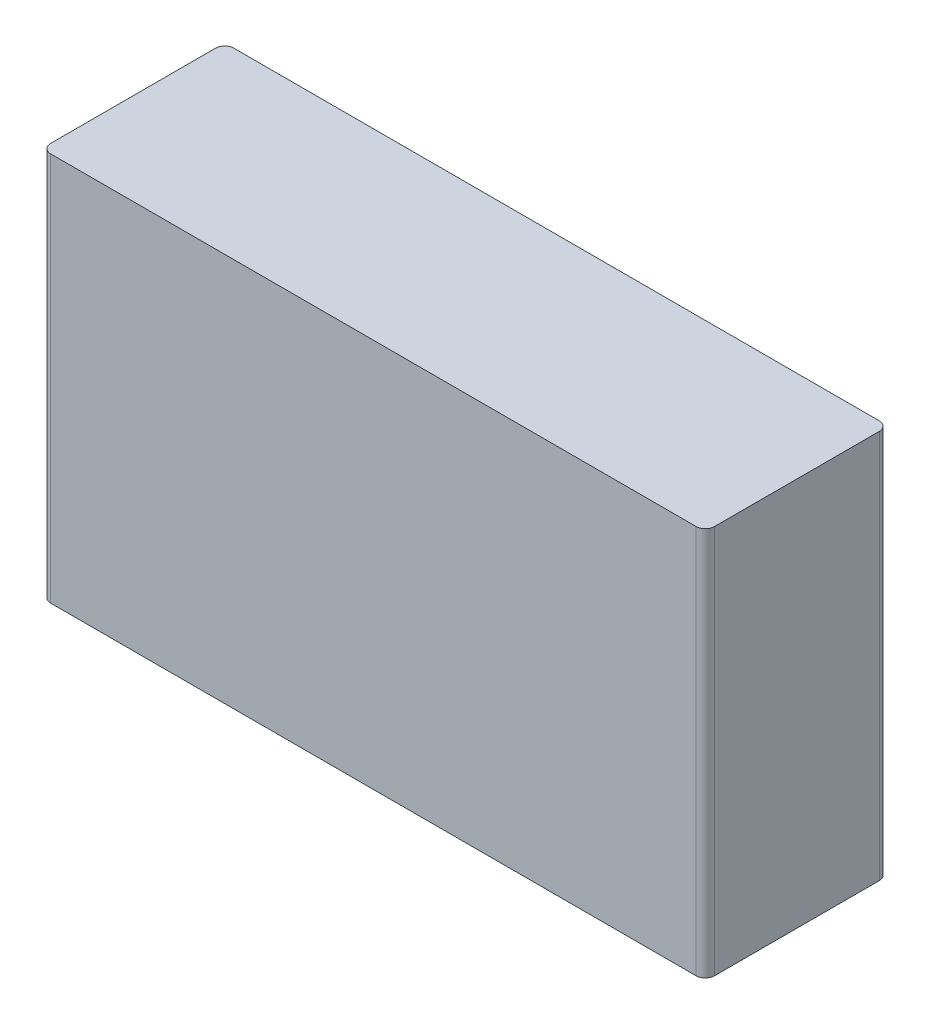
ISO-10303-21;
HEADER;
FILE_DESCRIPTION(('STEP AP214'),'2;1');
FILE_NAME('part.step','',(''),(''),'','','');
FILE_SCHEMA(('AUTOMOTIVE_DESIGN { 1 0 10303 214 1 1 1 1 }'));
ENDSEC;
DATA;
#1=APPLICATION_CONTEXT('core data for automotive mechanical design processes');
#2=APPLICATION_PROTOCOL_DEFINITION('international standard','automotive_design',2000,#1);
#3=PRODUCT_CONTEXT('',#1,'mechanical');
#4=PRODUCT('Part','Part','',(#3));
#5=PRODUCT_RELATED_PRODUCT_CATEGORY('part','',(#4));
#6=PRODUCT_DEFINITION_FORMATION('','',#4);
#7=PRODUCT_DEFINITION_CONTEXT('part definition',#1,'design');
#8=PRODUCT_DEFINITION('design','',#6,#7);
#9=PRODUCT_DEFINITION_SHAPE('','',#8);
#10=(LENGTH_UNIT() NAMED_UNIT(*) SI_UNIT(.MILLI.,.METRE.));
#11=(NAMED_UNIT(*) PLANE_ANGLE_UNIT() SI_UNIT($,.RADIAN.));
#12=(NAMED_UNIT(*) SI_UNIT($,.STERADIAN.) SOLID_ANGLE_UNIT());
#13=UNCERTAINTY_MEASURE_WITH_UNIT(LENGTH_MEASURE(1.E-05),#10,'distance_accuracy_value','');
#14=(GEOMETRIC_REPRESENTATION_CONTEXT(3) GLOBAL_UNCERTAINTY_ASSIGNED_CONTEXT((#13)) GLOBAL_UNIT_ASSIGNED_CONTEXT((#10,
#11,#12)) REPRESENTATION_CONTEXT('',''));
#15=CARTESIAN_POINT('',(0.,0.,0.));
#16=DIRECTION('',(0.,0.,1.));
#17=DIRECTION('',(1.,0.,0.));
#18=AXIS2_PLACEMENT_3D('',#15,#16,#17);
#19=CARTESIAN_POINT('',(0.775,0.425,0.));
#20=DIRECTION('',(0.,1.,0.));
#21=DIRECTION('',(1.,0.,0.));
#22=AXIS2_PLACEMENT_3D('',#19,#20,#21);
#23=PLANE('',#22);
#24=DIRECTION('',(1.,0.,0.));
#25=VECTOR('',#24,1.);
#26=CARTESIAN_POINT('',(0.75,0.425,0.05));
#27=LINE('',#26,#25);
#28=CARTESIAN_POINT('',(-0.705,0.425,0.05));
#29=VERTEX_POINT('',#28);
#30=CARTESIAN_POINT('',(0.705,0.425,0.05));
#31=VERTEX_POINT('',#30);
#32=EDGE_CURVE('E40',#29,#31,#27,.T.);
#33=ORIENTED_EDGE('',*,*,#32,.F.);
#34=CARTESIAN_POINT('',(-0.705,0.425,0.07));
#35=DIRECTION('',(0.,-1.,0.));
#36=DIRECTION('',(-0.707106781186548,0.,-0.707106781186548));
#37=AXIS2_PLACEMENT_3D('',#34,#35,#36);
#38=CIRCLE('',#37,0.02);
#39=CARTESIAN_POINT('',(-0.725,0.425,0.07));
#40=VERTEX_POINT('',#39);
#41=EDGE_CURVE('E169',#40,#29,#38,.T.);
#42=ORIENTED_EDGE('',*,*,#41,.F.);
#43=DIRECTION('',(0.,0.,-1.));
#44=VECTOR('',#43,1.);
#45=CARTESIAN_POINT('',(-0.725,0.425,0.025));
#46=LINE('',#45,#44);
#47=CARTESIAN_POINT('',(-0.725,0.425,0.43));
#48=VERTEX_POINT('',#47);
#49=EDGE_CURVE('E163',#48,#40,#46,.T.);
#50=ORIENTED_EDGE('',*,*,#49,.F.);
#51=CARTESIAN_POINT('',(-0.705,0.425,0.43));
#52=DIRECTION('',(0.,-1.,0.));
#53=DIRECTION('',(-0.707106781186548,0.,0.707106781186548));
#54=AXIS2_PLACEMENT_3D('',#51,#52,#53);
#55=CIRCLE('',#54,0.02);
#56=CARTESIAN_POINT('',(-0.705,0.425,0.45));
#57=VERTEX_POINT('',#56);
#58=EDGE_CURVE('E11',#57,#48,#55,.T.);
#59=ORIENTED_EDGE('',*,*,#58,.F.);
#60=DIRECTION('',(-1.,0.,0.));
#61=VECTOR('',#60,1.);
#62=CARTESIAN_POINT('',(0.025,0.425,0.45));
#63=LINE('',#62,#61);
#64=CARTESIAN_POINT('',(0.705,0.425,0.45));
#65=VERTEX_POINT('',#64);
#66=EDGE_CURVE('E143',#65,#57,#63,.T.);
#67=ORIENTED_EDGE('',*,*,#66,.F.);
#68=CARTESIAN_POINT('',(0.705,0.425,0.43));
#69=DIRECTION('',(0.,-1.,0.));
#70=DIRECTION('',(0.707106781186548,0.,0.707106781186548));
#71=AXIS2_PLACEMENT_3D('',#68,#69,#70);
#72=CIRCLE('',#71,0.02);
#73=CARTESIAN_POINT('',(0.725,0.425,0.43));
#74=VERTEX_POINT('',#73);
#75=EDGE_CURVE('E102',#74,#65,#72,.T.);
#76=ORIENTED_EDGE('',*,*,#75,.F.);
#77=DIRECTION('',(0.,0.,1.));
#78=VECTOR('',#77,1.);
#79=CARTESIAN_POINT('',(0.725,0.425,0.225));
#80=LINE('',#79,#78);
#81=CARTESIAN_POINT('',(0.725,0.425,0.07));
#82=VERTEX_POINT('',#81);
#83=EDGE_CURVE('E97',#82,#74,#80,.T.);
#84=ORIENTED_EDGE('',*,*,#83,.F.);
#85=CARTESIAN_POINT('',(0.705,0.425,0.07));
#86=DIRECTION('',(0.,-1.,0.));
#87=DIRECTION('',(0.707106781186548,0.,-0.707106781186548));
#88=AXIS2_PLACEMENT_3D('',#85,#86,#87);
#89=CIRCLE('',#88,0.02);
#90=EDGE_CURVE('E99',#31,#82,#89,.T.);
#91=ORIENTED_EDGE('',*,*,#90,.F.);
#92=EDGE_LOOP('',(#33,#42,#50,#59,#67,#76,#84,#91));
#93=FACE_BOUND('',#92,.T.);
#94=ADVANCED_FACE('F17',(#93),#23,.T.);
#95=CARTESIAN_POINT('',(-0.705,0.425,0.43));
#96=DIRECTION('',(0.,1.,0.));
#97=DIRECTION('',(-0.707106781186548,0.,0.707106781186548));
#98=AXIS2_PLACEMENT_3D('',#95,#96,#97);
#99=CYLINDRICAL_SURFACE('',#98,0.02);
#100=ORIENTED_EDGE('',*,*,#58,.T.);
#101=DIRECTION('',(0.,-1.,0.));
#102=VECTOR('',#101,1.);
#103=CARTESIAN_POINT('',(-0.725,0.425,0.43));
#104=LINE('',#103,#102);
#105=CARTESIAN_POINT('',(-0.725,-0.425,0.43));
#106=VERTEX_POINT('',#105);
#107=EDGE_CURVE('E27',#48,#106,#104,.T.);
#108=ORIENTED_EDGE('',*,*,#107,.T.);
#109=CARTESIAN_POINT('',(-0.705,-0.425,0.43));
#110=DIRECTION('',(0.,1.,0.));
#111=DIRECTION('',(-0.707106781186548,0.,0.707106781186548));
#112=AXIS2_PLACEMENT_3D('',#109,#110,#111);
#113=CIRCLE('',#112,0.02);
#114=CARTESIAN_POINT('',(-0.705,-0.425,0.45));
#115=VERTEX_POINT('',#114);
#116=EDGE_CURVE('E20',#106,#115,#113,.T.);
#117=ORIENTED_EDGE('',*,*,#116,.T.);
#118=DIRECTION('',(0.,1.,0.));
#119=VECTOR('',#118,1.);
#120=CARTESIAN_POINT('',(-0.705,0.425,0.45));
#121=LINE('',#120,#119);
#122=EDGE_CURVE('E166',#115,#57,#121,.T.);
#123=ORIENTED_EDGE('',*,*,#122,.T.);
#124=EDGE_LOOP('',(#100,#108,#117,#123));
#125=FACE_BOUND('',#124,.T.);
#126=ADVANCED_FACE('F213',(#125),#99,.T.);
#127=CARTESIAN_POINT('',(-0.775,-0.425,0.));
#128=DIRECTION('',(0.,-1.,0.));
#129=DIRECTION('',(0.,0.,-1.));
#130=AXIS2_PLACEMENT_3D('',#127,#128,#129);
#131=PLANE('',#130);
#132=DIRECTION('',(-1.,0.,0.));
#133=VECTOR('',#132,1.);
#134=CARTESIAN_POINT('',(-0.025,-0.425,0.05));
#135=LINE('',#134,#133);
#136=CARTESIAN_POINT('',(0.705,-0.425,0.05));
#137=VERTEX_POINT('',#136);
#138=CARTESIAN_POINT('',(-0.705,-0.425,0.05));
#139=VERTEX_POINT('',#138);
#140=EDGE_CURVE('E141',#137,#139,#135,.T.);
#141=ORIENTED_EDGE('',*,*,#140,.F.);
#142=CARTESIAN_POINT('',(0.705,-0.425,0.07));
#143=DIRECTION('',(0.,1.,0.));
#144=DIRECTION('',(0.707106781186548,0.,-0.707106781186548));
#145=AXIS2_PLACEMENT_3D('',#142,#143,#144);
#146=CIRCLE('',#145,0.02);
#147=CARTESIAN_POINT('',(0.725,-0.425,0.07));
#148=VERTEX_POINT('',#147);
#149=EDGE_CURVE('E135',#148,#137,#146,.T.);
#150=ORIENTED_EDGE('',*,*,#149,.F.);
#151=DIRECTION('',(0.,0.,-1.));
#152=VECTOR('',#151,1.);
#153=CARTESIAN_POINT('',(0.725,-0.425,0.225));
#154=LINE('',#153,#152);
#155=CARTESIAN_POINT('',(0.725,-0.425,0.43));
#156=VERTEX_POINT('',#155);
#157=EDGE_CURVE('E109',#156,#148,#154,.T.);
#158=ORIENTED_EDGE('',*,*,#157,.F.);
#159=CARTESIAN_POINT('',(0.705,-0.425,0.43));
#160=DIRECTION('',(0.,1.,0.));
#161=DIRECTION('',(0.707106781186548,0.,0.707106781186548));
#162=AXIS2_PLACEMENT_3D('',#159,#160,#161);
#163=CIRCLE('',#162,0.02);
#164=CARTESIAN_POINT('',(0.705,-0.425,0.45));
#165=VERTEX_POINT('',#164);
#166=EDGE_CURVE('E154',#165,#156,#163,.T.);
#167=ORIENTED_EDGE('',*,*,#166,.F.);
#168=DIRECTION('',(1.,0.,0.));
#169=VECTOR('',#168,1.);
#170=CARTESIAN_POINT('',(-0.75,-0.425,0.45));
#171=LINE('',#170,#169);
#172=EDGE_CURVE('E148',#115,#165,#171,.T.);
#173=ORIENTED_EDGE('',*,*,#172,.F.);
#174=ORIENTED_EDGE('',*,*,#116,.F.);
#175=DIRECTION('',(0.,0.,1.));
#176=VECTOR('',#175,1.);
#177=CARTESIAN_POINT('',(-0.725,-0.425,0.025));
#178=LINE('',#177,#176);
#179=CARTESIAN_POINT('',(-0.725,-0.425,0.07));
#180=VERTEX_POINT('',#179);
#181=EDGE_CURVE('E167',#180,#106,#178,.T.);
#182=ORIENTED_EDGE('',*,*,#181,.F.);
#183=CARTESIAN_POINT('',(-0.705,-0.425,0.07));
#184=DIRECTION('',(0.,1.,0.));
#185=DIRECTION('',(-0.707106781186548,0.,-0.707106781186548));
#186=AXIS2_PLACEMENT_3D('',#183,#184,#185);
#187=CIRCLE('',#186,0.02);
#188=EDGE_CURVE('E134',#139,#180,#187,.T.);
#189=ORIENTED_EDGE('',*,*,#188,.F.);
#190=EDGE_LOOP('',(#141,#150,#158,#167,#173,#174,#182,#189));
#191=FACE_BOUND('',#190,.T.);
#192=ADVANCED_FACE('F189',(#191),#131,.T.);
#193=CARTESIAN_POINT('',(-0.725,0.425,0.05));
#194=DIRECTION('',(-1.,0.,0.));
#195=DIRECTION('',(0.,1.,0.));
#196=AXIS2_PLACEMENT_3D('',#193,#194,#195);
#197=PLANE('',#196);
#198=ORIENTED_EDGE('',*,*,#107,.F.);
#199=ORIENTED_EDGE('',*,*,#49,.T.);
#200=DIRECTION('',(0.,1.,0.));
#201=VECTOR('',#200,1.);
#202=CARTESIAN_POINT('',(-0.725,0.425,0.07));
#203=LINE('',#202,#201);
#204=EDGE_CURVE('E131',#180,#40,#203,.T.);
#205=ORIENTED_EDGE('',*,*,#204,.F.);
#206=ORIENTED_EDGE('',*,*,#181,.T.);
#207=EDGE_LOOP('',(#198,#199,#205,#206));
#208=FACE_BOUND('',#207,.T.);
#209=ADVANCED_FACE('F206',(#208),#197,.T.);
#210=CARTESIAN_POINT('',(-0.705,0.425,0.07));
#211=DIRECTION('',(0.,1.,0.));
#212=DIRECTION('',(-0.707106781186548,0.,-0.707106781186548));
#213=AXIS2_PLACEMENT_3D('',#210,#211,#212);
#214=CYLINDRICAL_SURFACE('',#213,0.02);
#215=ORIENTED_EDGE('',*,*,#41,.T.);
#216=DIRECTION('',(0.,-1.,0.));
#217=VECTOR('',#216,1.);
#218=CARTESIAN_POINT('',(-0.705,0.425,0.05));
#219=LINE('',#218,#217);
#220=EDGE_CURVE('E129',#29,#139,#219,.T.);
#221=ORIENTED_EDGE('',*,*,#220,.T.);
#222=ORIENTED_EDGE('',*,*,#188,.T.);
#223=ORIENTED_EDGE('',*,*,#204,.T.);
#224=EDGE_LOOP('',(#215,#221,#222,#223));
#225=FACE_BOUND('',#224,.T.);
#226=ADVANCED_FACE('F210',(#225),#214,.T.);
#227=CARTESIAN_POINT('',(0.705,0.425,0.07));
#228=DIRECTION('',(0.,-1.,0.));
#229=DIRECTION('',(0.707106781186548,0.,-0.707106781186548));
#230=AXIS2_PLACEMENT_3D('',#227,#228,#229);
#231=CYLINDRICAL_SURFACE('',#230,0.02);
#232=ORIENTED_EDGE('',*,*,#149,.T.);
#233=DIRECTION('',(0.,1.,0.));
#234=VECTOR('',#233,1.);
#235=CARTESIAN_POINT('',(0.705,0.425,0.05));
#236=LINE('',#235,#234);
#237=EDGE_CURVE('E116',#137,#31,#236,.T.);
#238=ORIENTED_EDGE('',*,*,#237,.T.);
#239=ORIENTED_EDGE('',*,*,#90,.T.);
#240=DIRECTION('',(0.,-1.,0.));
#241=VECTOR('',#240,1.);
#242=CARTESIAN_POINT('',(0.725,0.425,0.07));
#243=LINE('',#242,#241);
#244=EDGE_CURVE('E108',#82,#148,#243,.T.);
#245=ORIENTED_EDGE('',*,*,#244,.T.);
#246=EDGE_LOOP('',(#232,#238,#239,#245));
#247=FACE_BOUND('',#246,.T.);
#248=ADVANCED_FACE('F114',(#247),#231,.T.);
#249=CARTESIAN_POINT('',(0.725,0.425,0.45));
#250=DIRECTION('',(1.,0.,0.));
#251=DIRECTION('',(0.,1.,0.));
#252=AXIS2_PLACEMENT_3D('',#249,#250,#251);
#253=PLANE('',#252);
#254=ORIENTED_EDGE('',*,*,#244,.F.);
#255=ORIENTED_EDGE('',*,*,#83,.T.);
#256=DIRECTION('',(0.,1.,0.));
#257=VECTOR('',#256,1.);
#258=CARTESIAN_POINT('',(0.725,0.425,0.43));
#259=LINE('',#258,#257);
#260=EDGE_CURVE('E151',#156,#74,#259,.T.);
#261=ORIENTED_EDGE('',*,*,#260,.F.);
#262=ORIENTED_EDGE('',*,*,#157,.T.);
#263=EDGE_LOOP('',(#254,#255,#261,#262));
#264=FACE_BOUND('',#263,.T.);
#265=ADVANCED_FACE('F119',(#264),#253,.T.);
#266=CARTESIAN_POINT('',(0.705,0.425,0.43));
#267=DIRECTION('',(0.,1.,0.));
#268=DIRECTION('',(0.707106781186548,0.,0.707106781186548));
#269=AXIS2_PLACEMENT_3D('',#266,#267,#268);
#270=CYLINDRICAL_SURFACE('',#269,0.02);
#271=ORIENTED_EDGE('',*,*,#75,.T.);
#272=DIRECTION('',(0.,-1.,0.));
#273=VECTOR('',#272,1.);
#274=CARTESIAN_POINT('',(0.705,0.425,0.45));
#275=LINE('',#274,#273);
#276=EDGE_CURVE('E157',#65,#165,#275,.T.);
#277=ORIENTED_EDGE('',*,*,#276,.T.);
#278=ORIENTED_EDGE('',*,*,#166,.T.);
#279=ORIENTED_EDGE('',*,*,#260,.T.);
#280=EDGE_LOOP('',(#271,#277,#278,#279));
#281=FACE_BOUND('',#280,.T.);
#282=ADVANCED_FACE('F184',(#281),#270,.T.);
#283=CARTESIAN_POINT('',(-0.725,0.425,0.45));
#284=DIRECTION('',(0.,0.,1.));
#285=DIRECTION('',(1.,0.,0.));
#286=AXIS2_PLACEMENT_3D('',#283,#284,#285);
#287=PLANE('',#286);
#288=ORIENTED_EDGE('',*,*,#122,.F.);
#289=ORIENTED_EDGE('',*,*,#172,.T.);
#290=ORIENTED_EDGE('',*,*,#276,.F.);
#291=ORIENTED_EDGE('',*,*,#66,.T.);
#292=EDGE_LOOP('',(#288,#289,#290,#291));
#293=FACE_BOUND('',#292,.T.);
#294=ADVANCED_FACE('F215',(#293),#287,.T.);
#295=CARTESIAN_POINT('',(0.725,0.425,0.05));
#296=DIRECTION('',(0.,0.,-1.));
#297=DIRECTION('',(0.,-1.,0.));
#298=AXIS2_PLACEMENT_3D('',#295,#296,#297);
#299=PLANE('',#298);
#300=ORIENTED_EDGE('',*,*,#237,.F.);
#301=ORIENTED_EDGE('',*,*,#140,.T.);
#302=ORIENTED_EDGE('',*,*,#220,.F.);
#303=ORIENTED_EDGE('',*,*,#32,.T.);
#304=EDGE_LOOP('',(#300,#301,#302,#303));
#305=FACE_BOUND('',#304,.T.);
#306=ADVANCED_FACE('F192',(#305),#299,.T.);
#307=CLOSED_SHELL('',(#94,#126,#192,#209,#226,#248,#265,#282,#294,#306));
#308=MANIFOLD_SOLID_BREP('B1',#307);
#309=ADVANCED_BREP_SHAPE_REPRESENTATION('',(#18,#308),#14);
#310=SHAPE_DEFINITION_REPRESENTATION(#9,#309);
ENDSEC;
END-ISO-10303-21;
